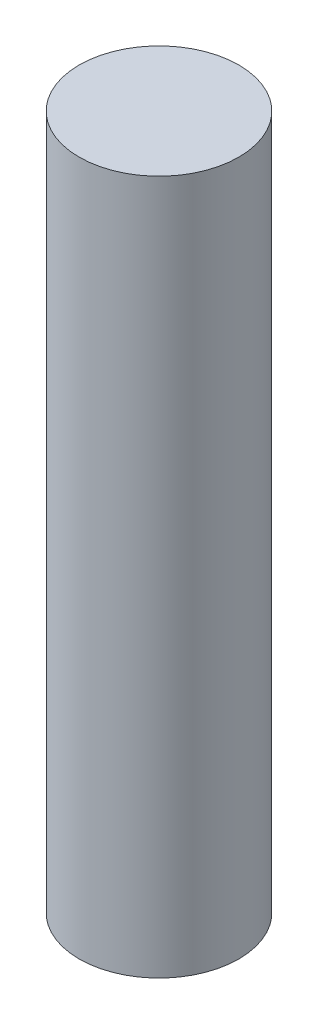
ISO-10303-21;
HEADER;
FILE_DESCRIPTION(('STEP AP214'),'2;1');
FILE_NAME('part.step','',(''),(''),'','','');
FILE_SCHEMA(('AUTOMOTIVE_DESIGN { 1 0 10303 214 1 1 1 1 }'));
ENDSEC;
DATA;
#1=APPLICATION_CONTEXT('core data for automotive mechanical design processes');
#2=APPLICATION_PROTOCOL_DEFINITION('international standard','automotive_design',2000,#1);
#3=PRODUCT_CONTEXT('',#1,'mechanical');
#4=PRODUCT('Part','Part','',(#3));
#5=PRODUCT_RELATED_PRODUCT_CATEGORY('part','',(#4));
#6=PRODUCT_DEFINITION_FORMATION('','',#4);
#7=PRODUCT_DEFINITION_CONTEXT('part definition',#1,'design');
#8=PRODUCT_DEFINITION('design','',#6,#7);
#9=PRODUCT_DEFINITION_SHAPE('','',#8);
#10=(LENGTH_UNIT() NAMED_UNIT(*) SI_UNIT(.MILLI.,.METRE.));
#11=(NAMED_UNIT(*) PLANE_ANGLE_UNIT() SI_UNIT($,.RADIAN.));
#12=(NAMED_UNIT(*) SI_UNIT($,.STERADIAN.) SOLID_ANGLE_UNIT());
#13=UNCERTAINTY_MEASURE_WITH_UNIT(LENGTH_MEASURE(1.E-05),#10,'distance_accuracy_value','');
#14=(GEOMETRIC_REPRESENTATION_CONTEXT(3) GLOBAL_UNCERTAINTY_ASSIGNED_CONTEXT((#13)) GLOBAL_UNIT_ASSIGNED_CONTEXT((#10,
#11,#12)) REPRESENTATION_CONTEXT('',''));
#15=CARTESIAN_POINT('',(0.,0.,0.));
#16=DIRECTION('',(0.,0.,1.));
#17=DIRECTION('',(1.,0.,0.));
#18=AXIS2_PLACEMENT_3D('',#15,#16,#17);
#19=CARTESIAN_POINT('',(0.,43.5,0.));
#20=DIRECTION('',(0.,-1.,0.));
#21=DIRECTION('',(0.,0.,-1.));
#22=AXIS2_PLACEMENT_3D('',#19,#20,#21);
#23=CYLINDRICAL_SURFACE('',#22,5.);
#24=CARTESIAN_POINT('',(0.,43.5,0.));
#25=DIRECTION('',(0.,1.,0.));
#26=DIRECTION('',(0.,0.,1.));
#27=AXIS2_PLACEMENT_3D('',#24,#25,#26);
#28=CIRCLE('',#27,5.);
#29=CARTESIAN_POINT('',(0.,43.5,5.));
#30=VERTEX_POINT('',#29);
#31=EDGE_CURVE('E10',#30,#30,#28,.T.);
#32=ORIENTED_EDGE('',*,*,#31,.F.);
#33=EDGE_LOOP('',(#32));
#34=FACE_BOUND('',#33,.T.);
#35=CARTESIAN_POINT('',(0.,0.,0.));
#36=DIRECTION('',(0.,1.,0.));
#37=DIRECTION('',(0.,0.,1.));
#38=AXIS2_PLACEMENT_3D('',#35,#36,#37);
#39=CIRCLE('',#38,5.);
#40=CARTESIAN_POINT('',(0.,0.,5.));
#41=VERTEX_POINT('',#40);
#42=EDGE_CURVE('E40',#41,#41,#39,.T.);
#43=ORIENTED_EDGE('',*,*,#42,.T.);
#44=EDGE_LOOP('',(#43));
#45=FACE_BOUND('',#44,.T.);
#46=ADVANCED_FACE('F37',(#34,#45),#23,.T.);
#47=CARTESIAN_POINT('',(0.,43.5,0.));
#48=DIRECTION('',(0.,1.,0.));
#49=DIRECTION('',(0.,0.,1.));
#50=AXIS2_PLACEMENT_3D('',#47,#48,#49);
#51=PLANE('',#50);
#52=ORIENTED_EDGE('',*,*,#31,.T.);
#53=EDGE_LOOP('',(#52));
#54=FACE_BOUND('',#53,.T.);
#55=ADVANCED_FACE('F54',(#54),#51,.T.);
#56=CARTESIAN_POINT('',(0.,0.,0.));
#57=DIRECTION('',(0.,1.,0.));
#58=DIRECTION('',(0.,0.,1.));
#59=AXIS2_PLACEMENT_3D('',#56,#57,#58);
#60=PLANE('',#59);
#61=ORIENTED_EDGE('',*,*,#42,.F.);
#62=EDGE_LOOP('',(#61));
#63=FACE_BOUND('',#62,.T.);
#64=ADVANCED_FACE('F52',(#63),#60,.F.);
#65=CLOSED_SHELL('',(#46,#55,#64));
#66=MANIFOLD_SOLID_BREP('B2',#65);
#67=ADVANCED_BREP_SHAPE_REPRESENTATION('',(#18,#66),#14);
#68=SHAPE_DEFINITION_REPRESENTATION(#9,#67);
ENDSEC;
END-ISO-10303-21;
